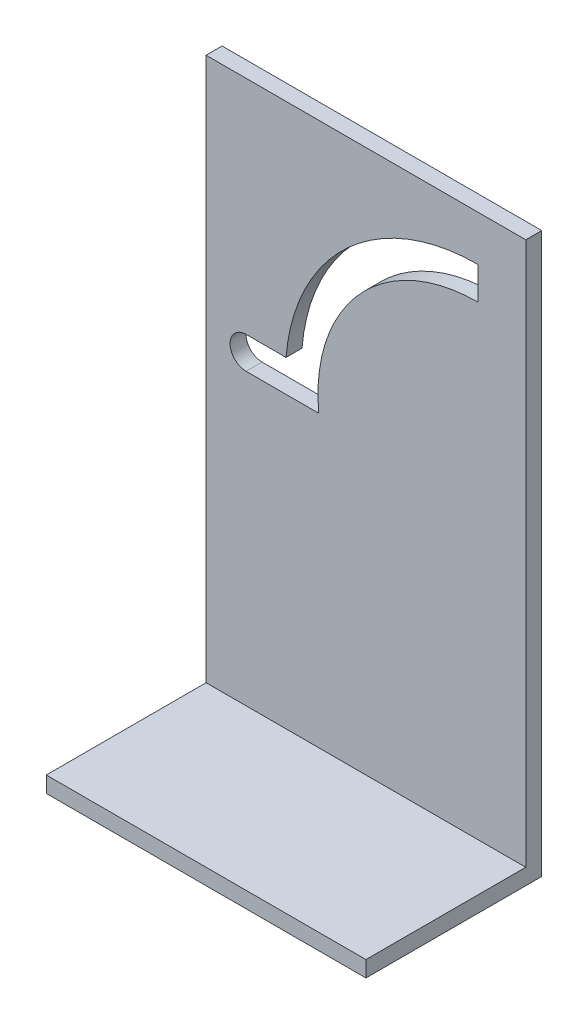
ISO-10303-21;
HEADER;
FILE_DESCRIPTION(('STEP AP214'),'2;1');
FILE_NAME('part.step','',(''),(''),'','','');
FILE_SCHEMA(('AUTOMOTIVE_DESIGN { 1 0 10303 214 1 1 1 1 }'));
ENDSEC;
DATA;
#1=APPLICATION_CONTEXT('core data for automotive mechanical design processes');
#2=APPLICATION_PROTOCOL_DEFINITION('international standard','automotive_design',2000,#1);
#3=PRODUCT_CONTEXT('',#1,'mechanical');
#4=PRODUCT('Part','Part','',(#3));
#5=PRODUCT_RELATED_PRODUCT_CATEGORY('part','',(#4));
#6=PRODUCT_DEFINITION_FORMATION('','',#4);
#7=PRODUCT_DEFINITION_CONTEXT('part definition',#1,'design');
#8=PRODUCT_DEFINITION('design','',#6,#7);
#9=PRODUCT_DEFINITION_SHAPE('','',#8);
#10=(LENGTH_UNIT() NAMED_UNIT(*) SI_UNIT(.MILLI.,.METRE.));
#11=(NAMED_UNIT(*) PLANE_ANGLE_UNIT() SI_UNIT($,.RADIAN.));
#12=(NAMED_UNIT(*) SI_UNIT($,.STERADIAN.) SOLID_ANGLE_UNIT());
#13=UNCERTAINTY_MEASURE_WITH_UNIT(LENGTH_MEASURE(1.E-05),#10,'distance_accuracy_value','');
#14=(GEOMETRIC_REPRESENTATION_CONTEXT(3) GLOBAL_UNCERTAINTY_ASSIGNED_CONTEXT((#13)) GLOBAL_UNIT_ASSIGNED_CONTEXT((#10,
#11,#12)) REPRESENTATION_CONTEXT('',''));
#15=CARTESIAN_POINT('',(0.,0.,0.));
#16=DIRECTION('',(0.,0.,1.));
#17=DIRECTION('',(1.,0.,0.));
#18=AXIS2_PLACEMENT_3D('',#15,#16,#17);
#19=CARTESIAN_POINT('',(0.,0.,2.));
#20=DIRECTION('',(0.,0.,1.));
#21=DIRECTION('',(1.,0.,0.));
#22=AXIS2_PLACEMENT_3D('',#19,#20,#21);
#23=PLANE('',#22);
#24=DIRECTION('',(-1.,0.,0.));
#25=VECTOR('',#24,1.);
#26=CARTESIAN_POINT('',(-30.2714458192476,-37.7194207726717,2.));
#27=LINE('',#26,#25);
#28=CARTESIAN_POINT('',(9.72855418075238,-37.7194207726717,2.));
#29=VERTEX_POINT('',#28);
#30=CARTESIAN_POINT('',(-30.2714458192476,-37.7194207726717,2.));
#31=VERTEX_POINT('',#30);
#32=EDGE_CURVE('E50',#29,#31,#27,.T.);
#33=ORIENTED_EDGE('',*,*,#32,.F.);
#34=DIRECTION('',(0.,1.,0.));
#35=VECTOR('',#34,1.);
#36=CARTESIAN_POINT('',(9.72855418075238,-39.7194207726717,2.));
#37=LINE('',#36,#35);
#38=CARTESIAN_POINT('',(9.72855418075238,30.2805792273283,2.));
#39=VERTEX_POINT('',#38);
#40=EDGE_CURVE('E208',#29,#39,#37,.T.);
#41=ORIENTED_EDGE('',*,*,#40,.T.);
#42=DIRECTION('',(-1.,0.,0.));
#43=VECTOR('',#42,1.);
#44=CARTESIAN_POINT('',(9.72855418075238,30.2805792273283,2.));
#45=LINE('',#44,#43);
#46=CARTESIAN_POINT('',(-30.2714458192476,30.2805792273283,2.));
#47=VERTEX_POINT('',#46);
#48=EDGE_CURVE('E202',#39,#47,#45,.T.);
#49=ORIENTED_EDGE('',*,*,#48,.T.);
#50=DIRECTION('',(0.,-1.,0.));
#51=VECTOR('',#50,1.);
#52=CARTESIAN_POINT('',(-30.2714458192476,30.2805792273283,2.));
#53=LINE('',#52,#51);
#54=EDGE_CURVE('E205',#47,#31,#53,.T.);
#55=ORIENTED_EDGE('',*,*,#54,.T.);
#56=EDGE_LOOP('',(#33,#41,#49,#55));
#57=FACE_BOUND('',#56,.T.);
#58=DIRECTION('',(1.,0.,0.));
#59=VECTOR('',#58,1.);
#60=CARTESIAN_POINT('',(-25.2714458192476,-1.46942077267171,2.));
#61=LINE('',#60,#59);
#62=CARTESIAN_POINT('',(-25.2714458192476,-1.46942077267171,2.));
#63=VERTEX_POINT('',#62);
#64=CARTESIAN_POINT('',(-16.17119456138,-1.46942077267171,2.));
#65=VERTEX_POINT('',#64);
#66=EDGE_CURVE('E161',#63,#65,#61,.T.);
#67=ORIENTED_EDGE('',*,*,#66,.F.);
#68=CARTESIAN_POINT('',(-25.2714458192476,0.530579227328291,2.));
#69=DIRECTION('',(0.,0.,1.));
#70=DIRECTION('',(1.,0.,0.));
#71=AXIS2_PLACEMENT_3D('',#68,#69,#70);
#72=CIRCLE('',#71,2.);
#73=CARTESIAN_POINT('',(-25.2714458192476,2.53057922732829,2.));
#74=VERTEX_POINT('',#73);
#75=EDGE_CURVE('E159',#74,#63,#72,.T.);
#76=ORIENTED_EDGE('',*,*,#75,.F.);
#77=DIRECTION('',(-1.,0.,0.));
#78=VECTOR('',#77,1.);
#79=CARTESIAN_POINT('',(-25.2714458192476,2.53057922732829,2.));
#80=LINE('',#79,#78);
#81=CARTESIAN_POINT('',(-20.2714458192476,2.53057922732829,2.));
#82=VERTEX_POINT('',#81);
#83=EDGE_CURVE('E170',#82,#74,#80,.T.);
#84=ORIENTED_EDGE('',*,*,#83,.F.);
#85=CARTESIAN_POINT('',(3.72855418075238,0.530579227328292,2.));
#86=DIRECTION('',(0.,0.,1.));
#87=DIRECTION('',(1.,0.,0.));
#88=AXIS2_PLACEMENT_3D('',#85,#86,#87);
#89=CIRCLE('',#88,24.0831891575846);
#90=CARTESIAN_POINT('',(3.72855418075238,24.6137683849129,2.));
#91=VERTEX_POINT('',#90);
#92=EDGE_CURVE('E168',#91,#82,#89,.T.);
#93=ORIENTED_EDGE('',*,*,#92,.F.);
#94=DIRECTION('',(0.,1.,0.));
#95=VECTOR('',#94,1.);
#96=CARTESIAN_POINT('',(3.72855418075238,20.5305792273283,2.));
#97=LINE('',#96,#95);
#98=CARTESIAN_POINT('',(3.72855418075238,20.5305792273283,2.));
#99=VERTEX_POINT('',#98);
#100=EDGE_CURVE('E166',#99,#91,#97,.T.);
#101=ORIENTED_EDGE('',*,*,#100,.F.);
#102=CARTESIAN_POINT('',(3.72855418075238,0.530579227328292,2.));
#103=DIRECTION('',(0.,0.,-1.));
#104=DIRECTION('',(1.,0.,0.));
#105=AXIS2_PLACEMENT_3D('',#102,#103,#104);
#106=CIRCLE('',#105,20.);
#107=EDGE_CURVE('E164',#65,#99,#106,.T.);
#108=ORIENTED_EDGE('',*,*,#107,.F.);
#109=EDGE_LOOP('',(#67,#76,#84,#93,#101,#108));
#110=FACE_BOUND('',#109,.T.);
#111=ADVANCED_FACE('F35',(#57,#110),#23,.T.);
#112=CARTESIAN_POINT('',(0.,0.,0.));
#113=DIRECTION('',(0.,0.,1.));
#114=DIRECTION('',(1.,0.,0.));
#115=AXIS2_PLACEMENT_3D('',#112,#113,#114);
#116=PLANE('',#115);
#117=DIRECTION('',(-1.,0.,0.));
#118=VECTOR('',#117,1.);
#119=CARTESIAN_POINT('',(9.72855418075238,30.2805792273283,0.));
#120=LINE('',#119,#118);
#121=CARTESIAN_POINT('',(9.72855418075238,30.2805792273283,0.));
#122=VERTEX_POINT('',#121);
#123=CARTESIAN_POINT('',(-30.2714458192476,30.2805792273283,0.));
#124=VERTEX_POINT('',#123);
#125=EDGE_CURVE('E201',#122,#124,#120,.T.);
#126=ORIENTED_EDGE('',*,*,#125,.F.);
#127=DIRECTION('',(0.,1.,0.));
#128=VECTOR('',#127,1.);
#129=CARTESIAN_POINT('',(9.72855418075238,-39.7194207726717,0.));
#130=LINE('',#129,#128);
#131=CARTESIAN_POINT('',(9.72855418075238,-39.7194207726717,0.));
#132=VERTEX_POINT('',#131);
#133=EDGE_CURVE('E206',#132,#122,#130,.T.);
#134=ORIENTED_EDGE('',*,*,#133,.F.);
#135=DIRECTION('',(1.,0.,0.));
#136=VECTOR('',#135,1.);
#137=CARTESIAN_POINT('',(-30.2714458192476,-39.7194207726717,0.));
#138=LINE('',#137,#136);
#139=CARTESIAN_POINT('',(-30.2714458192476,-39.7194207726717,0.));
#140=VERTEX_POINT('',#139);
#141=EDGE_CURVE('E131',#140,#132,#138,.T.);
#142=ORIENTED_EDGE('',*,*,#141,.F.);
#143=DIRECTION('',(0.,-1.,0.));
#144=VECTOR('',#143,1.);
#145=CARTESIAN_POINT('',(-30.2714458192476,30.2805792273283,0.));
#146=LINE('',#145,#144);
#147=EDGE_CURVE('E212',#124,#140,#146,.T.);
#148=ORIENTED_EDGE('',*,*,#147,.F.);
#149=EDGE_LOOP('',(#126,#134,#142,#148));
#150=FACE_BOUND('',#149,.T.);
#151=CARTESIAN_POINT('',(-25.2714458192476,0.530579227328291,0.));
#152=DIRECTION('',(0.,0.,1.));
#153=DIRECTION('',(1.,0.,0.));
#154=AXIS2_PLACEMENT_3D('',#151,#152,#153);
#155=CIRCLE('',#154,2.);
#156=CARTESIAN_POINT('',(-25.2714458192476,2.53057922732829,0.));
#157=VERTEX_POINT('',#156);
#158=CARTESIAN_POINT('',(-25.2714458192476,-1.46942077267171,0.));
#159=VERTEX_POINT('',#158);
#160=EDGE_CURVE('E158',#157,#159,#155,.T.);
#161=ORIENTED_EDGE('',*,*,#160,.T.);
#162=DIRECTION('',(1.,0.,0.));
#163=VECTOR('',#162,1.);
#164=CARTESIAN_POINT('',(-20.2714458192476,-1.46942077267171,0.));
#165=LINE('',#164,#163);
#166=CARTESIAN_POINT('',(-16.17119456138,-1.46942077267171,0.));
#167=VERTEX_POINT('',#166);
#168=EDGE_CURVE('E175',#159,#167,#165,.T.);
#169=ORIENTED_EDGE('',*,*,#168,.T.);
#170=CARTESIAN_POINT('',(3.72855418075238,0.530579227328292,0.));
#171=DIRECTION('',(0.,0.,-1.));
#172=DIRECTION('',(1.,0.,0.));
#173=AXIS2_PLACEMENT_3D('',#170,#171,#172);
#174=CIRCLE('',#173,20.);
#175=CARTESIAN_POINT('',(3.72855418075238,20.5305792273283,0.));
#176=VERTEX_POINT('',#175);
#177=EDGE_CURVE('E178',#167,#176,#174,.T.);
#178=ORIENTED_EDGE('',*,*,#177,.T.);
#179=DIRECTION('',(0.,1.,0.));
#180=VECTOR('',#179,1.);
#181=CARTESIAN_POINT('',(3.72855418075238,20.5305792273283,0.));
#182=LINE('',#181,#180);
#183=CARTESIAN_POINT('',(3.72855418075238,24.6137683849129,0.));
#184=VERTEX_POINT('',#183);
#185=EDGE_CURVE('E181',#176,#184,#182,.T.);
#186=ORIENTED_EDGE('',*,*,#185,.T.);
#187=CARTESIAN_POINT('',(3.72855418075238,0.530579227328292,0.));
#188=DIRECTION('',(0.,0.,1.));
#189=DIRECTION('',(1.,0.,0.));
#190=AXIS2_PLACEMENT_3D('',#187,#188,#189);
#191=CIRCLE('',#190,24.0831891575846);
#192=CARTESIAN_POINT('',(-20.2714458192476,2.5305792273283,0.));
#193=VERTEX_POINT('',#192);
#194=EDGE_CURVE('E184',#184,#193,#191,.T.);
#195=ORIENTED_EDGE('',*,*,#194,.T.);
#196=DIRECTION('',(-1.,0.,0.));
#197=VECTOR('',#196,1.);
#198=CARTESIAN_POINT('',(-25.2714458192476,2.53057922732829,0.));
#199=LINE('',#198,#197);
#200=EDGE_CURVE('E162',#193,#157,#199,.T.);
#201=ORIENTED_EDGE('',*,*,#200,.T.);
#202=EDGE_LOOP('',(#161,#169,#178,#186,#195,#201));
#203=FACE_BOUND('',#202,.T.);
#204=ADVANCED_FACE('F220',(#150,#203),#116,.F.);
#205=CARTESIAN_POINT('',(9.72855418075238,30.2805792273283,2.));
#206=DIRECTION('',(0.,-1.,0.));
#207=DIRECTION('',(1.,0.,0.));
#208=AXIS2_PLACEMENT_3D('',#205,#206,#207);
#209=PLANE('',#208);
#210=ORIENTED_EDGE('',*,*,#125,.T.);
#211=DIRECTION('',(0.,0.,-1.));
#212=VECTOR('',#211,1.);
#213=CARTESIAN_POINT('',(-30.2714458192476,30.2805792273283,2.));
#214=LINE('',#213,#212);
#215=EDGE_CURVE('E11',#47,#124,#214,.T.);
#216=ORIENTED_EDGE('',*,*,#215,.F.);
#217=ORIENTED_EDGE('',*,*,#48,.F.);
#218=DIRECTION('',(0.,0.,-1.));
#219=VECTOR('',#218,1.);
#220=CARTESIAN_POINT('',(9.72855418075238,30.2805792273283,2.));
#221=LINE('',#220,#219);
#222=EDGE_CURVE('E134',#39,#122,#221,.T.);
#223=ORIENTED_EDGE('',*,*,#222,.T.);
#224=EDGE_LOOP('',(#210,#216,#217,#223));
#225=FACE_BOUND('',#224,.T.);
#226=ADVANCED_FACE('F37',(#225),#209,.F.);
#227=CARTESIAN_POINT('',(-30.2714458192476,30.2805792273283,2.));
#228=DIRECTION('',(1.,0.,0.));
#229=DIRECTION('',(0.,1.,0.));
#230=AXIS2_PLACEMENT_3D('',#227,#228,#229);
#231=PLANE('',#230);
#232=ORIENTED_EDGE('',*,*,#147,.T.);
#233=DIRECTION('',(0.,0.,-1.));
#234=VECTOR('',#233,1.);
#235=CARTESIAN_POINT('',(-30.2714458192476,-39.7194207726717,2.));
#236=LINE('',#235,#234);
#237=CARTESIAN_POINT('',(-30.2714458192476,-39.7194207726717,22.));
#238=VERTEX_POINT('',#237);
#239=EDGE_CURVE('E43',#238,#140,#236,.T.);
#240=ORIENTED_EDGE('',*,*,#239,.F.);
#241=DIRECTION('',(0.,-1.,0.));
#242=VECTOR('',#241,1.);
#243=CARTESIAN_POINT('',(-30.2714458192476,-39.7194207726717,22.));
#244=LINE('',#243,#242);
#245=CARTESIAN_POINT('',(-30.2714458192476,-37.7194207726717,22.));
#246=VERTEX_POINT('',#245);
#247=EDGE_CURVE('E148',#246,#238,#244,.T.);
#248=ORIENTED_EDGE('',*,*,#247,.F.);
#249=DIRECTION('',(0.,0.,-1.));
#250=VECTOR('',#249,1.);
#251=CARTESIAN_POINT('',(-30.2714458192476,-37.7194207726717,22.));
#252=LINE('',#251,#250);
#253=EDGE_CURVE('E153',#246,#31,#252,.T.);
#254=ORIENTED_EDGE('',*,*,#253,.T.);
#255=ORIENTED_EDGE('',*,*,#54,.F.);
#256=ORIENTED_EDGE('',*,*,#215,.T.);
#257=EDGE_LOOP('',(#232,#240,#248,#254,#255,#256));
#258=FACE_BOUND('',#257,.T.);
#259=ADVANCED_FACE('F230',(#258),#231,.F.);
#260=CARTESIAN_POINT('',(-30.2714458192476,-39.7194207726717,2.));
#261=DIRECTION('',(0.,1.,0.));
#262=DIRECTION('',(0.,0.,1.));
#263=AXIS2_PLACEMENT_3D('',#260,#261,#262);
#264=PLANE('',#263);
#265=ORIENTED_EDGE('',*,*,#141,.T.);
#266=DIRECTION('',(0.,0.,-1.));
#267=VECTOR('',#266,1.);
#268=CARTESIAN_POINT('',(9.72855418075238,-39.7194207726717,2.));
#269=LINE('',#268,#267);
#270=CARTESIAN_POINT('',(9.72855418075238,-39.7194207726717,22.));
#271=VERTEX_POINT('',#270);
#272=EDGE_CURVE('E124',#271,#132,#269,.T.);
#273=ORIENTED_EDGE('',*,*,#272,.F.);
#274=DIRECTION('',(1.,0.,0.));
#275=VECTOR('',#274,1.);
#276=CARTESIAN_POINT('',(9.72855418075238,-39.7194207726717,22.));
#277=LINE('',#276,#275);
#278=EDGE_CURVE('E129',#238,#271,#277,.T.);
#279=ORIENTED_EDGE('',*,*,#278,.F.);
#280=ORIENTED_EDGE('',*,*,#239,.T.);
#281=EDGE_LOOP('',(#265,#273,#279,#280));
#282=FACE_BOUND('',#281,.T.);
#283=ADVANCED_FACE('F126',(#282),#264,.F.);
#284=CARTESIAN_POINT('',(9.72855418075238,-39.7194207726717,2.));
#285=DIRECTION('',(-1.,0.,0.));
#286=DIRECTION('',(0.,0.,1.));
#287=AXIS2_PLACEMENT_3D('',#284,#285,#286);
#288=PLANE('',#287);
#289=ORIENTED_EDGE('',*,*,#133,.T.);
#290=ORIENTED_EDGE('',*,*,#222,.F.);
#291=ORIENTED_EDGE('',*,*,#40,.F.);
#292=DIRECTION('',(0.,0.,-1.));
#293=VECTOR('',#292,1.);
#294=CARTESIAN_POINT('',(9.72855418075238,-37.7194207726717,22.));
#295=LINE('',#294,#293);
#296=CARTESIAN_POINT('',(9.72855418075238,-37.7194207726717,22.));
#297=VERTEX_POINT('',#296);
#298=EDGE_CURVE('E140',#297,#29,#295,.T.);
#299=ORIENTED_EDGE('',*,*,#298,.F.);
#300=DIRECTION('',(0.,1.,0.));
#301=VECTOR('',#300,1.);
#302=CARTESIAN_POINT('',(9.72855418075238,-37.7194207726717,22.));
#303=LINE('',#302,#301);
#304=EDGE_CURVE('E137',#271,#297,#303,.T.);
#305=ORIENTED_EDGE('',*,*,#304,.F.);
#306=ORIENTED_EDGE('',*,*,#272,.T.);
#307=EDGE_LOOP('',(#289,#290,#291,#299,#305,#306));
#308=FACE_BOUND('',#307,.T.);
#309=ADVANCED_FACE('F138',(#308),#288,.F.);
#310=CARTESIAN_POINT('',(-25.2714458192476,0.530579227328291,2.));
#311=DIRECTION('',(0.,0.,-1.));
#312=DIRECTION('',(-1.,0.,0.));
#313=AXIS2_PLACEMENT_3D('',#310,#311,#312);
#314=CYLINDRICAL_SURFACE('',#313,2.);
#315=ORIENTED_EDGE('',*,*,#160,.F.);
#316=DIRECTION('',(0.,0.,-1.));
#317=VECTOR('',#316,1.);
#318=CARTESIAN_POINT('',(-25.2714458192476,2.53057922732829,2.));
#319=LINE('',#318,#317);
#320=EDGE_CURVE('E172',#74,#157,#319,.T.);
#321=ORIENTED_EDGE('',*,*,#320,.F.);
#322=ORIENTED_EDGE('',*,*,#75,.T.);
#323=DIRECTION('',(0.,0.,-1.));
#324=VECTOR('',#323,1.);
#325=CARTESIAN_POINT('',(-25.2714458192476,-1.46942077267171,2.));
#326=LINE('',#325,#324);
#327=EDGE_CURVE('E198',#63,#159,#326,.T.);
#328=ORIENTED_EDGE('',*,*,#327,.T.);
#329=EDGE_LOOP('',(#315,#321,#322,#328));
#330=FACE_BOUND('',#329,.T.);
#331=ADVANCED_FACE('F244',(#330),#314,.F.);
#332=CARTESIAN_POINT('',(-20.2714458192476,-1.46942077267171,2.));
#333=DIRECTION('',(0.,1.,0.));
#334=DIRECTION('',(0.,0.,1.));
#335=AXIS2_PLACEMENT_3D('',#332,#333,#334);
#336=PLANE('',#335);
#337=ORIENTED_EDGE('',*,*,#168,.F.);
#338=ORIENTED_EDGE('',*,*,#327,.F.);
#339=ORIENTED_EDGE('',*,*,#66,.T.);
#340=DIRECTION('',(0.,0.,-1.));
#341=VECTOR('',#340,1.);
#342=CARTESIAN_POINT('',(-16.17119456138,-1.46942077267171,2.));
#343=LINE('',#342,#341);
#344=EDGE_CURVE('E196',#65,#167,#343,.T.);
#345=ORIENTED_EDGE('',*,*,#344,.T.);
#346=EDGE_LOOP('',(#337,#338,#339,#345));
#347=FACE_BOUND('',#346,.T.);
#348=ADVANCED_FACE('F251',(#347),#336,.T.);
#349=CARTESIAN_POINT('',(3.72855418075238,0.530579227328292,2.));
#350=DIRECTION('',(0.,0.,-1.));
#351=DIRECTION('',(-1.,0.,0.));
#352=AXIS2_PLACEMENT_3D('',#349,#350,#351);
#353=CYLINDRICAL_SURFACE('',#352,20.);
#354=ORIENTED_EDGE('',*,*,#177,.F.);
#355=ORIENTED_EDGE('',*,*,#344,.F.);
#356=ORIENTED_EDGE('',*,*,#107,.T.);
#357=DIRECTION('',(0.,0.,-1.));
#358=VECTOR('',#357,1.);
#359=CARTESIAN_POINT('',(3.72855418075238,20.5305792273283,2.));
#360=LINE('',#359,#358);
#361=EDGE_CURVE('E194',#99,#176,#360,.T.);
#362=ORIENTED_EDGE('',*,*,#361,.T.);
#363=EDGE_LOOP('',(#354,#355,#356,#362));
#364=FACE_BOUND('',#363,.T.);
#365=ADVANCED_FACE('F256',(#364),#353,.T.);
#366=CARTESIAN_POINT('',(3.72855418075238,20.5305792273283,2.));
#367=DIRECTION('',(-1.,0.,0.));
#368=DIRECTION('',(0.,0.,1.));
#369=AXIS2_PLACEMENT_3D('',#366,#367,#368);
#370=PLANE('',#369);
#371=ORIENTED_EDGE('',*,*,#185,.F.);
#372=ORIENTED_EDGE('',*,*,#361,.F.);
#373=ORIENTED_EDGE('',*,*,#100,.T.);
#374=DIRECTION('',(0.,0.,-1.));
#375=VECTOR('',#374,1.);
#376=CARTESIAN_POINT('',(3.72855418075238,24.6137683849129,2.));
#377=LINE('',#376,#375);
#378=EDGE_CURVE('E192',#91,#184,#377,.T.);
#379=ORIENTED_EDGE('',*,*,#378,.T.);
#380=EDGE_LOOP('',(#371,#372,#373,#379));
#381=FACE_BOUND('',#380,.T.);
#382=ADVANCED_FACE('F277',(#381),#370,.T.);
#383=CARTESIAN_POINT('',(3.72855418075238,0.530579227328292,2.));
#384=DIRECTION('',(0.,0.,-1.));
#385=DIRECTION('',(-1.,0.,0.));
#386=AXIS2_PLACEMENT_3D('',#383,#384,#385);
#387=CYLINDRICAL_SURFACE('',#386,24.0831891575846);
#388=ORIENTED_EDGE('',*,*,#194,.F.);
#389=ORIENTED_EDGE('',*,*,#378,.F.);
#390=ORIENTED_EDGE('',*,*,#92,.T.);
#391=DIRECTION('',(0.,0.,-1.));
#392=VECTOR('',#391,1.);
#393=CARTESIAN_POINT('',(-20.2714458192476,2.5305792273283,2.));
#394=LINE('',#393,#392);
#395=EDGE_CURVE('E58',#82,#193,#394,.T.);
#396=ORIENTED_EDGE('',*,*,#395,.T.);
#397=EDGE_LOOP('',(#388,#389,#390,#396));
#398=FACE_BOUND('',#397,.T.);
#399=ADVANCED_FACE('F267',(#398),#387,.F.);
#400=CARTESIAN_POINT('',(-25.2714458192476,2.53057922732829,2.));
#401=DIRECTION('',(0.,-1.,0.));
#402=DIRECTION('',(1.,0.,0.));
#403=AXIS2_PLACEMENT_3D('',#400,#401,#402);
#404=PLANE('',#403);
#405=ORIENTED_EDGE('',*,*,#200,.F.);
#406=ORIENTED_EDGE('',*,*,#395,.F.);
#407=ORIENTED_EDGE('',*,*,#83,.T.);
#408=ORIENTED_EDGE('',*,*,#320,.T.);
#409=EDGE_LOOP('',(#405,#406,#407,#408));
#410=FACE_BOUND('',#409,.T.);
#411=ADVANCED_FACE('F261',(#410),#404,.T.);
#412=CARTESIAN_POINT('',(-30.2714458192476,-37.7194207726717,22.));
#413=DIRECTION('',(0.,-1.,0.));
#414=DIRECTION('',(0.,0.,-1.));
#415=AXIS2_PLACEMENT_3D('',#412,#413,#414);
#416=PLANE('',#415);
#417=ORIENTED_EDGE('',*,*,#32,.T.);
#418=ORIENTED_EDGE('',*,*,#253,.F.);
#419=DIRECTION('',(-1.,0.,0.));
#420=VECTOR('',#419,1.);
#421=CARTESIAN_POINT('',(-30.2714458192476,-37.7194207726717,22.));
#422=LINE('',#421,#420);
#423=EDGE_CURVE('E143',#297,#246,#422,.T.);
#424=ORIENTED_EDGE('',*,*,#423,.F.);
#425=ORIENTED_EDGE('',*,*,#298,.T.);
#426=EDGE_LOOP('',(#417,#418,#424,#425));
#427=FACE_BOUND('',#426,.T.);
#428=ADVANCED_FACE('F228',(#427),#416,.F.);
#429=CARTESIAN_POINT('',(0.,0.,22.));
#430=DIRECTION('',(0.,0.,-1.));
#431=DIRECTION('',(-1.,0.,0.));
#432=AXIS2_PLACEMENT_3D('',#429,#430,#431);
#433=PLANE('',#432);
#434=ORIENTED_EDGE('',*,*,#278,.T.);
#435=ORIENTED_EDGE('',*,*,#304,.T.);
#436=ORIENTED_EDGE('',*,*,#423,.T.);
#437=ORIENTED_EDGE('',*,*,#247,.T.);
#438=EDGE_LOOP('',(#434,#435,#436,#437));
#439=FACE_BOUND('',#438,.T.);
#440=ADVANCED_FACE('F146',(#439),#433,.F.);
#441=CLOSED_SHELL('',(#111,#204,#226,#259,#283,#309,#331,#348,#365,#382,#399,#411,#428,#440));
#442=MANIFOLD_SOLID_BREP('B2',#441);
#443=ADVANCED_BREP_SHAPE_REPRESENTATION('',(#18,#442),#14);
#444=SHAPE_DEFINITION_REPRESENTATION(#9,#443);
ENDSEC;
END-ISO-10303-21;
